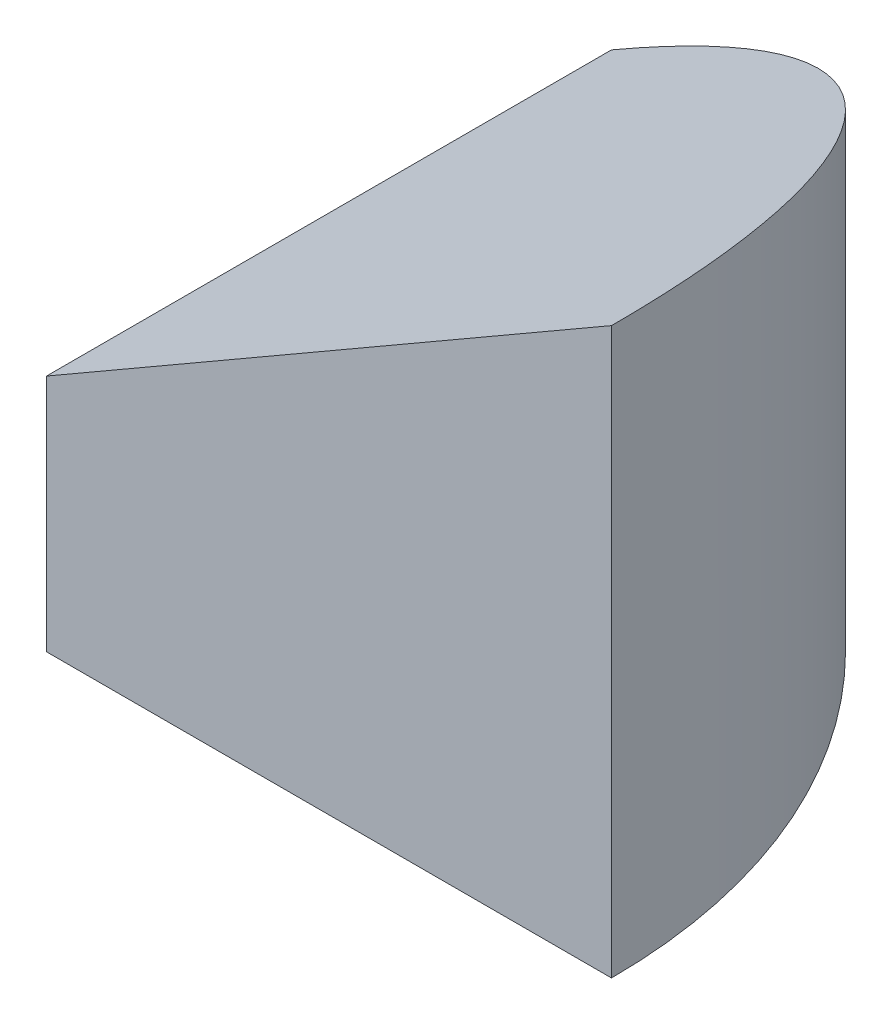
ISO-10303-21;
HEADER;
FILE_DESCRIPTION(('STEP AP214'),'2;1');
FILE_NAME('part.step','',(''),(''),'','','');
FILE_SCHEMA(('AUTOMOTIVE_DESIGN { 1 0 10303 214 1 1 1 1 }'));
ENDSEC;
DATA;
#1=APPLICATION_CONTEXT('core data for automotive mechanical design processes');
#2=APPLICATION_PROTOCOL_DEFINITION('international standard','automotive_design',2000,#1);
#3=PRODUCT_CONTEXT('',#1,'mechanical');
#4=PRODUCT('Part','Part','',(#3));
#5=PRODUCT_RELATED_PRODUCT_CATEGORY('part','',(#4));
#6=PRODUCT_DEFINITION_FORMATION('','',#4);
#7=PRODUCT_DEFINITION_CONTEXT('part definition',#1,'design');
#8=PRODUCT_DEFINITION('design','',#6,#7);
#9=PRODUCT_DEFINITION_SHAPE('','',#8);
#10=(LENGTH_UNIT() NAMED_UNIT(*) SI_UNIT(.MILLI.,.METRE.));
#11=(NAMED_UNIT(*) PLANE_ANGLE_UNIT() SI_UNIT($,.RADIAN.));
#12=(NAMED_UNIT(*) SI_UNIT($,.STERADIAN.) SOLID_ANGLE_UNIT());
#13=UNCERTAINTY_MEASURE_WITH_UNIT(LENGTH_MEASURE(1.E-05),#10,'distance_accuracy_value','');
#14=(GEOMETRIC_REPRESENTATION_CONTEXT(3) GLOBAL_UNCERTAINTY_ASSIGNED_CONTEXT((#13)) GLOBAL_UNIT_ASSIGNED_CONTEXT((#10,
#11,#12)) REPRESENTATION_CONTEXT('',''));
#15=CARTESIAN_POINT('',(0.,0.,0.));
#16=DIRECTION('',(0.,0.,1.));
#17=DIRECTION('',(1.,0.,0.));
#18=AXIS2_PLACEMENT_3D('',#15,#16,#17);
#19=CARTESIAN_POINT('',(0.,30.,0.));
#20=DIRECTION('',(0.,-1.,0.));
#21=DIRECTION('',(0.,0.,-1.));
#22=AXIS2_PLACEMENT_3D('',#19,#20,#21);
#23=CYLINDRICAL_SURFACE('',#22,30.);
#24=DIRECTION('',(0.,1.,0.));
#25=VECTOR('',#24,1.);
#26=CARTESIAN_POINT('',(0.,0.,-30.));
#27=LINE('',#26,#25);
#28=CARTESIAN_POINT('',(0.,0.,-30.));
#29=VERTEX_POINT('',#28);
#30=CARTESIAN_POINT('',(0.,12.6794919243112,-30.));
#31=VERTEX_POINT('',#30);
#32=EDGE_CURVE('E46',#29,#31,#27,.T.);
#33=ORIENTED_EDGE('',*,*,#32,.T.);
#34=CARTESIAN_POINT('',(0.,12.6794919243112,0.));
#35=DIRECTION('',(0.500000000000001,-0.866025403784438,0.));
#36=DIRECTION('',(-0.866025403784438,-0.500000000000001,0.));
#37=AXIS2_PLACEMENT_3D('',#34,#35,#36);
#38=ELLIPSE('',#37,34.6410161513776,30.);
#39=CARTESIAN_POINT('',(30.,30.,0.));
#40=VERTEX_POINT('',#39);
#41=EDGE_CURVE('E72',#31,#40,#38,.T.);
#42=ORIENTED_EDGE('',*,*,#41,.T.);
#43=DIRECTION('',(0.,1.,0.));
#44=VECTOR('',#43,1.);
#45=CARTESIAN_POINT('',(30.,0.,0.));
#46=LINE('',#45,#44);
#47=CARTESIAN_POINT('',(30.,0.,0.));
#48=VERTEX_POINT('',#47);
#49=EDGE_CURVE('E86',#48,#40,#46,.T.);
#50=ORIENTED_EDGE('',*,*,#49,.F.);
#51=CARTESIAN_POINT('',(0.,0.,0.));
#52=DIRECTION('',(0.,1.,0.));
#53=DIRECTION('',(0.,0.,1.));
#54=AXIS2_PLACEMENT_3D('',#51,#52,#53);
#55=CIRCLE('',#54,30.);
#56=EDGE_CURVE('E11',#48,#29,#55,.T.);
#57=ORIENTED_EDGE('',*,*,#56,.T.);
#58=EDGE_LOOP('',(#33,#42,#50,#57));
#59=FACE_BOUND('',#58,.T.);
#60=ADVANCED_FACE('F39',(#59),#23,.T.);
#61=CARTESIAN_POINT('',(0.,0.,0.));
#62=DIRECTION('',(0.,1.,0.));
#63=DIRECTION('',(0.,0.,1.));
#64=AXIS2_PLACEMENT_3D('',#61,#62,#63);
#65=PLANE('',#64);
#66=DIRECTION('',(-1.,0.,0.));
#67=VECTOR('',#66,1.);
#68=CARTESIAN_POINT('',(0.,0.,0.));
#69=LINE('',#68,#67);
#70=CARTESIAN_POINT('',(0.,0.,0.));
#71=VERTEX_POINT('',#70);
#72=EDGE_CURVE('E79',#48,#71,#69,.T.);
#73=ORIENTED_EDGE('',*,*,#72,.T.);
#74=DIRECTION('',(0.,0.,-1.));
#75=VECTOR('',#74,1.);
#76=CARTESIAN_POINT('',(0.,0.,-30.));
#77=LINE('',#76,#75);
#78=EDGE_CURVE('E61',#71,#29,#77,.T.);
#79=ORIENTED_EDGE('',*,*,#78,.T.);
#80=ORIENTED_EDGE('',*,*,#56,.F.);
#81=EDGE_LOOP('',(#73,#79,#80));
#82=FACE_BOUND('',#81,.T.);
#83=ADVANCED_FACE('F94',(#82),#65,.F.);
#84=CARTESIAN_POINT('',(0.,0.,-30.));
#85=DIRECTION('',(1.,0.,0.));
#86=DIRECTION('',(0.,0.,-1.));
#87=AXIS2_PLACEMENT_3D('',#84,#85,#86);
#88=PLANE('',#87);
#89=DIRECTION('',(0.,1.,0.));
#90=VECTOR('',#89,1.);
#91=CARTESIAN_POINT('',(0.,0.,0.));
#92=LINE('',#91,#90);
#93=CARTESIAN_POINT('',(0.,12.6794919243112,0.));
#94=VERTEX_POINT('',#93);
#95=EDGE_CURVE('E82',#71,#94,#92,.T.);
#96=ORIENTED_EDGE('',*,*,#95,.T.);
#97=DIRECTION('',(0.,0.,1.));
#98=VECTOR('',#97,1.);
#99=CARTESIAN_POINT('',(0.,12.6794919243112,-30.));
#100=LINE('',#99,#98);
#101=EDGE_CURVE('E53',#31,#94,#100,.T.);
#102=ORIENTED_EDGE('',*,*,#101,.F.);
#103=ORIENTED_EDGE('',*,*,#32,.F.);
#104=ORIENTED_EDGE('',*,*,#78,.F.);
#105=EDGE_LOOP('',(#96,#102,#103,#104));
#106=FACE_BOUND('',#105,.T.);
#107=ADVANCED_FACE('F81',(#106),#88,.F.);
#108=CARTESIAN_POINT('',(0.,0.,0.));
#109=DIRECTION('',(0.,0.,-1.));
#110=DIRECTION('',(-1.,0.,0.));
#111=AXIS2_PLACEMENT_3D('',#108,#109,#110);
#112=PLANE('',#111);
#113=ORIENTED_EDGE('',*,*,#49,.T.);
#114=DIRECTION('',(0.866025403784438,0.500000000000001,0.));
#115=VECTOR('',#114,1.);
#116=CARTESIAN_POINT('',(30.,30.,0.));
#117=LINE('',#116,#115);
#118=EDGE_CURVE('E74',#94,#40,#117,.T.);
#119=ORIENTED_EDGE('',*,*,#118,.F.);
#120=ORIENTED_EDGE('',*,*,#95,.F.);
#121=ORIENTED_EDGE('',*,*,#72,.F.);
#122=EDGE_LOOP('',(#113,#119,#120,#121));
#123=FACE_BOUND('',#122,.T.);
#124=ADVANCED_FACE('F95',(#123),#112,.F.);
#125=CARTESIAN_POINT('',(30.,30.,-30.));
#126=DIRECTION('',(0.500000000000001,-0.866025403784438,0.));
#127=DIRECTION('',(0.866025403784438,0.500000000000001,0.));
#128=AXIS2_PLACEMENT_3D('',#125,#126,#127);
#129=PLANE('',#128);
#130=ORIENTED_EDGE('',*,*,#101,.T.);
#131=ORIENTED_EDGE('',*,*,#118,.T.);
#132=ORIENTED_EDGE('',*,*,#41,.F.);
#133=EDGE_LOOP('',(#130,#131,#132));
#134=FACE_BOUND('',#133,.T.);
#135=ADVANCED_FACE('F73',(#134),#129,.F.);
#136=CLOSED_SHELL('',(#60,#83,#107,#124,#135));
#137=MANIFOLD_SOLID_BREP('B2',#136);
#138=ADVANCED_BREP_SHAPE_REPRESENTATION('',(#18,#137),#14);
#139=SHAPE_DEFINITION_REPRESENTATION(#9,#138);
ENDSEC;
END-ISO-10303-21;
